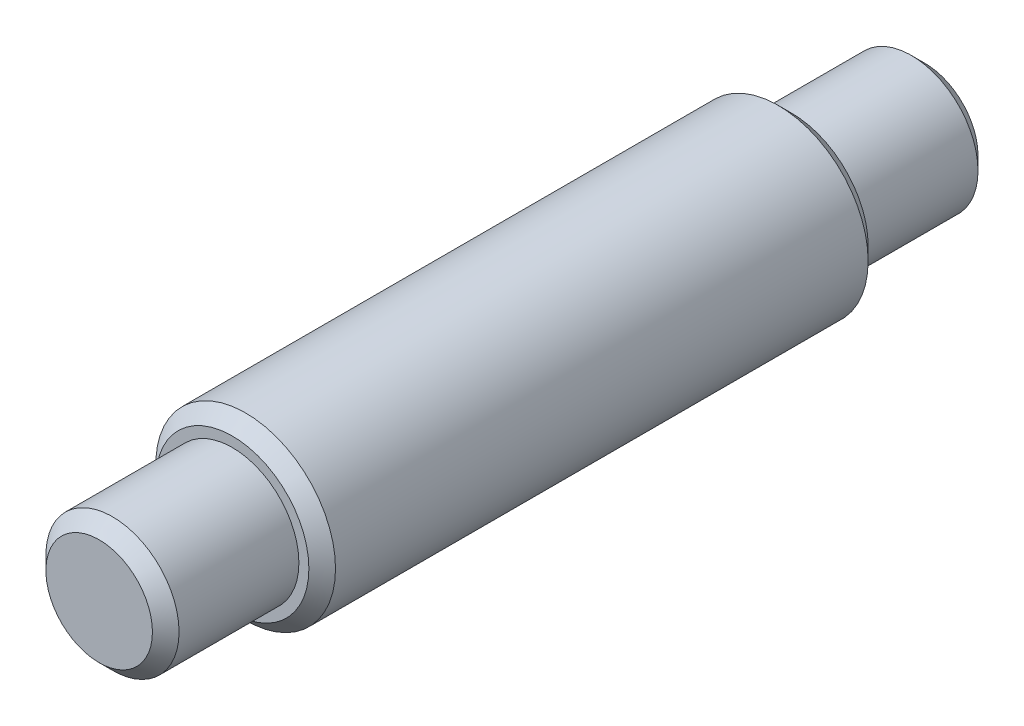
ISO-10303-21;
HEADER;
FILE_DESCRIPTION(('STEP AP214'),'2;1');
FILE_NAME('part.step','',(''),(''),'','','');
FILE_SCHEMA(('AUTOMOTIVE_DESIGN { 1 0 10303 214 1 1 1 1 }'));
ENDSEC;
DATA;
#1=APPLICATION_CONTEXT('core data for automotive mechanical design processes');
#2=APPLICATION_PROTOCOL_DEFINITION('international standard','automotive_design',2000,#1);
#3=PRODUCT_CONTEXT('',#1,'mechanical');
#4=PRODUCT('Part','Part','',(#3));
#5=PRODUCT_RELATED_PRODUCT_CATEGORY('part','',(#4));
#6=PRODUCT_DEFINITION_FORMATION('','',#4);
#7=PRODUCT_DEFINITION_CONTEXT('part definition',#1,'design');
#8=PRODUCT_DEFINITION('design','',#6,#7);
#9=PRODUCT_DEFINITION_SHAPE('','',#8);
#10=(LENGTH_UNIT() NAMED_UNIT(*) SI_UNIT(.MILLI.,.METRE.));
#11=(NAMED_UNIT(*) PLANE_ANGLE_UNIT() SI_UNIT($,.RADIAN.));
#12=(NAMED_UNIT(*) SI_UNIT($,.STERADIAN.) SOLID_ANGLE_UNIT());
#13=UNCERTAINTY_MEASURE_WITH_UNIT(LENGTH_MEASURE(1.E-05),#10,'distance_accuracy_value','');
#14=(GEOMETRIC_REPRESENTATION_CONTEXT(3) GLOBAL_UNCERTAINTY_ASSIGNED_CONTEXT((#13)) GLOBAL_UNIT_ASSIGNED_CONTEXT((#10,
#11,#12)) REPRESENTATION_CONTEXT('',''));
#15=CARTESIAN_POINT('',(0.,0.,0.));
#16=DIRECTION('',(0.,0.,1.));
#17=DIRECTION('',(1.,0.,0.));
#18=AXIS2_PLACEMENT_3D('',#15,#16,#17);
#19=CARTESIAN_POINT('',(0.,0.,-1.55));
#20=DIRECTION('',(0.,0.,1.));
#21=DIRECTION('',(1.,0.,0.));
#22=AXIS2_PLACEMENT_3D('',#19,#20,#21);
#23=CYLINDRICAL_SURFACE('',#22,0.25);
#24=CARTESIAN_POINT('',(0.,0.,1.5));
#25=DIRECTION('',(0.,0.,1.));
#26=DIRECTION('',(1.,0.,0.));
#27=AXIS2_PLACEMENT_3D('',#24,#25,#26);
#28=CIRCLE('',#27,0.25);
#29=CARTESIAN_POINT('',(0.25,0.,1.5));
#30=VERTEX_POINT('',#29);
#31=EDGE_CURVE('E41',#30,#30,#28,.F.);
#32=ORIENTED_EDGE('',*,*,#31,.T.);
#33=EDGE_LOOP('',(#32));
#34=FACE_BOUND('',#33,.T.);
#35=CARTESIAN_POINT('',(0.,0.,1.05));
#36=DIRECTION('',(0.,0.,1.));
#37=DIRECTION('',(1.,0.,0.));
#38=AXIS2_PLACEMENT_3D('',#35,#36,#37);
#39=CIRCLE('',#38,0.25);
#40=CARTESIAN_POINT('',(0.25,0.,1.05));
#41=VERTEX_POINT('',#40);
#42=EDGE_CURVE('E66',#41,#41,#39,.F.);
#43=ORIENTED_EDGE('',*,*,#42,.F.);
#44=EDGE_LOOP('',(#43));
#45=FACE_BOUND('',#44,.T.);
#46=ADVANCED_FACE('F33',(#34,#45),#23,.T.);
#47=CARTESIAN_POINT('',(0.,0.,1.55));
#48=DIRECTION('',(0.,0.,1.));
#49=DIRECTION('',(1.,0.,0.));
#50=AXIS2_PLACEMENT_3D('',#47,#48,#49);
#51=PLANE('',#50);
#52=CARTESIAN_POINT('',(0.,0.,1.55));
#53=DIRECTION('',(0.,0.,1.));
#54=DIRECTION('',(1.,0.,0.));
#55=AXIS2_PLACEMENT_3D('',#52,#53,#54);
#56=CIRCLE('',#55,0.2);
#57=CARTESIAN_POINT('',(0.2,0.,1.55));
#58=VERTEX_POINT('',#57);
#59=EDGE_CURVE('E45',#58,#58,#56,.T.);
#60=ORIENTED_EDGE('',*,*,#59,.T.);
#61=EDGE_LOOP('',(#60));
#62=FACE_BOUND('',#61,.T.);
#63=ADVANCED_FACE('F91',(#62),#51,.T.);
#64=CARTESIAN_POINT('',(0.,0.,1.05));
#65=DIRECTION('',(0.,0.,-1.));
#66=DIRECTION('',(-1.,0.,0.));
#67=AXIS2_PLACEMENT_3D('',#64,#65,#66);
#68=CYLINDRICAL_SURFACE('',#67,0.3375);
#69=CARTESIAN_POINT('',(0.,0.,-1.));
#70=DIRECTION('',(0.,0.,1.));
#71=DIRECTION('',(1.,0.,0.));
#72=AXIS2_PLACEMENT_3D('',#69,#70,#71);
#73=CIRCLE('',#72,0.3375);
#74=CARTESIAN_POINT('',(0.3375,0.,-1.));
#75=VERTEX_POINT('',#74);
#76=EDGE_CURVE('E60',#75,#75,#73,.T.);
#77=ORIENTED_EDGE('',*,*,#76,.T.);
#78=EDGE_LOOP('',(#77));
#79=FACE_BOUND('',#78,.T.);
#80=CARTESIAN_POINT('',(0.,0.,1.));
#81=DIRECTION('',(0.,0.,1.));
#82=DIRECTION('',(1.,0.,0.));
#83=AXIS2_PLACEMENT_3D('',#80,#81,#82);
#84=CIRCLE('',#83,0.3375);
#85=CARTESIAN_POINT('',(0.3375,0.,1.));
#86=VERTEX_POINT('',#85);
#87=EDGE_CURVE('E63',#86,#86,#84,.F.);
#88=ORIENTED_EDGE('',*,*,#87,.T.);
#89=EDGE_LOOP('',(#88));
#90=FACE_BOUND('',#89,.T.);
#91=ADVANCED_FACE('F87',(#79,#90),#68,.T.);
#92=CARTESIAN_POINT('',(0.,0.,1.05));
#93=DIRECTION('',(0.,0.,1.));
#94=DIRECTION('',(1.,0.,0.));
#95=AXIS2_PLACEMENT_3D('',#92,#93,#94);
#96=PLANE('',#95);
#97=CARTESIAN_POINT('',(0.,0.,1.05));
#98=DIRECTION('',(0.,0.,1.));
#99=DIRECTION('',(1.,0.,0.));
#100=AXIS2_PLACEMENT_3D('',#97,#98,#99);
#101=CIRCLE('',#100,0.2875);
#102=CARTESIAN_POINT('',(0.2875,0.,1.05));
#103=VERTEX_POINT('',#102);
#104=EDGE_CURVE('E10',#103,#103,#101,.T.);
#105=ORIENTED_EDGE('',*,*,#104,.T.);
#106=EDGE_LOOP('',(#105));
#107=FACE_BOUND('',#106,.T.);
#108=ORIENTED_EDGE('',*,*,#42,.T.);
#109=EDGE_LOOP('',(#108));
#110=FACE_BOUND('',#109,.T.);
#111=ADVANCED_FACE('F78',(#107,#110),#96,.T.);
#112=CARTESIAN_POINT('',(0.,0.,-1.05));
#113=DIRECTION('',(0.,0.,1.));
#114=DIRECTION('',(1.,0.,0.));
#115=AXIS2_PLACEMENT_3D('',#112,#113,#114);
#116=PLANE('',#115);
#117=CARTESIAN_POINT('',(0.,0.,-1.05));
#118=DIRECTION('',(0.,0.,1.));
#119=DIRECTION('',(1.,0.,0.));
#120=AXIS2_PLACEMENT_3D('',#117,#118,#119);
#121=CIRCLE('',#120,0.2875);
#122=CARTESIAN_POINT('',(0.2875,0.,-1.05));
#123=VERTEX_POINT('',#122);
#124=EDGE_CURVE('E57',#123,#123,#121,.F.);
#125=ORIENTED_EDGE('',*,*,#124,.T.);
#126=EDGE_LOOP('',(#125));
#127=FACE_BOUND('',#126,.T.);
#128=CARTESIAN_POINT('',(0.,0.,-1.05));
#129=DIRECTION('',(0.,0.,1.));
#130=DIRECTION('',(1.,0.,0.));
#131=AXIS2_PLACEMENT_3D('',#128,#129,#130);
#132=CIRCLE('',#131,0.25);
#133=CARTESIAN_POINT('',(0.25,0.,-1.05));
#134=VERTEX_POINT('',#133);
#135=EDGE_CURVE('E69',#134,#134,#132,.F.);
#136=ORIENTED_EDGE('',*,*,#135,.F.);
#137=EDGE_LOOP('',(#136));
#138=FACE_BOUND('',#137,.T.);
#139=ADVANCED_FACE('F75',(#127,#138),#116,.F.);
#140=CARTESIAN_POINT('',(0.,0.,-1.55));
#141=DIRECTION('',(0.,0.,1.));
#142=DIRECTION('',(1.,0.,0.));
#143=AXIS2_PLACEMENT_3D('',#140,#141,#142);
#144=PLANE('',#143);
#145=CARTESIAN_POINT('',(0.,0.,-1.55));
#146=DIRECTION('',(0.,0.,1.));
#147=DIRECTION('',(1.,0.,0.));
#148=AXIS2_PLACEMENT_3D('',#145,#146,#147);
#149=CIRCLE('',#148,0.199999999999998);
#150=CARTESIAN_POINT('',(0.199999999999998,0.,-1.55));
#151=VERTEX_POINT('',#150);
#152=EDGE_CURVE('E49',#151,#151,#149,.F.);
#153=ORIENTED_EDGE('',*,*,#152,.T.);
#154=EDGE_LOOP('',(#153));
#155=FACE_BOUND('',#154,.T.);
#156=ADVANCED_FACE('F77',(#155),#144,.F.);
#157=CARTESIAN_POINT('',(0.,0.,-1.5));
#158=DIRECTION('',(0.,0.,1.));
#159=DIRECTION('',(1.,0.,0.));
#160=AXIS2_PLACEMENT_3D('',#157,#158,#159);
#161=CIRCLE('',#160,0.25);
#162=CARTESIAN_POINT('',(0.25,0.,-1.5));
#163=VERTEX_POINT('',#162);
#164=EDGE_CURVE('E54',#163,#163,#161,.T.);
#165=ORIENTED_EDGE('',*,*,#164,.T.);
#166=EDGE_LOOP('',(#165));
#167=FACE_BOUND('',#166,.T.);
#168=ORIENTED_EDGE('',*,*,#135,.T.);
#169=EDGE_LOOP('',(#168));
#170=FACE_BOUND('',#169,.T.);
#171=ADVANCED_FACE('F73',(#167,#170),#23,.T.);
#172=CARTESIAN_POINT('',(0.,0.,-1.));
#173=DIRECTION('',(0.,0.,1.));
#174=DIRECTION('',(1.,0.,0.));
#175=AXIS2_PLACEMENT_3D('',#172,#173,#174);
#176=CONICAL_SURFACE('',#175,0.3375,0.785398163397452);
#177=ORIENTED_EDGE('',*,*,#124,.F.);
#178=EDGE_LOOP('',(#177));
#179=FACE_BOUND('',#178,.T.);
#180=ORIENTED_EDGE('',*,*,#76,.F.);
#181=EDGE_LOOP('',(#180));
#182=FACE_BOUND('',#181,.T.);
#183=ADVANCED_FACE('F101',(#179,#182),#176,.T.);
#184=CARTESIAN_POINT('',(0.,0.,-1.5));
#185=DIRECTION('',(0.,0.,1.));
#186=DIRECTION('',(1.,0.,0.));
#187=AXIS2_PLACEMENT_3D('',#184,#185,#186);
#188=CONICAL_SURFACE('',#187,0.25,0.785398163397453);
#189=ORIENTED_EDGE('',*,*,#152,.F.);
#190=EDGE_LOOP('',(#189));
#191=FACE_BOUND('',#190,.T.);
#192=ORIENTED_EDGE('',*,*,#164,.F.);
#193=EDGE_LOOP('',(#192));
#194=FACE_BOUND('',#193,.T.);
#195=ADVANCED_FACE('F106',(#191,#194),#188,.T.);
#196=CARTESIAN_POINT('',(0.,0.,1.55));
#197=DIRECTION('',(0.,0.,-1.));
#198=DIRECTION('',(-1.,0.,0.));
#199=AXIS2_PLACEMENT_3D('',#196,#197,#198);
#200=CONICAL_SURFACE('',#199,0.2,0.785398163397451);
#201=ORIENTED_EDGE('',*,*,#31,.F.);
#202=EDGE_LOOP('',(#201));
#203=FACE_BOUND('',#202,.T.);
#204=ORIENTED_EDGE('',*,*,#59,.F.);
#205=EDGE_LOOP('',(#204));
#206=FACE_BOUND('',#205,.T.);
#207=ADVANCED_FACE('F111',(#203,#206),#200,.T.);
#208=CARTESIAN_POINT('',(0.,0.,1.05));
#209=DIRECTION('',(0.,0.,-1.));
#210=DIRECTION('',(-1.,0.,0.));
#211=AXIS2_PLACEMENT_3D('',#208,#209,#210);
#212=CONICAL_SURFACE('',#211,0.2875,0.785398163397445);
#213=ORIENTED_EDGE('',*,*,#87,.F.);
#214=EDGE_LOOP('',(#213));
#215=FACE_BOUND('',#214,.T.);
#216=ORIENTED_EDGE('',*,*,#104,.F.);
#217=EDGE_LOOP('',(#216));
#218=FACE_BOUND('',#217,.T.);
#219=ADVANCED_FACE('F36',(#215,#218),#212,.T.);
#220=CLOSED_SHELL('',(#46,#63,#91,#111,#139,#156,#171,#183,#195,#207,#219));
#221=MANIFOLD_SOLID_BREP('B2',#220);
#222=ADVANCED_BREP_SHAPE_REPRESENTATION('',(#18,#221),#14);
#223=SHAPE_DEFINITION_REPRESENTATION(#9,#222);
ENDSEC;
END-ISO-10303-21;
